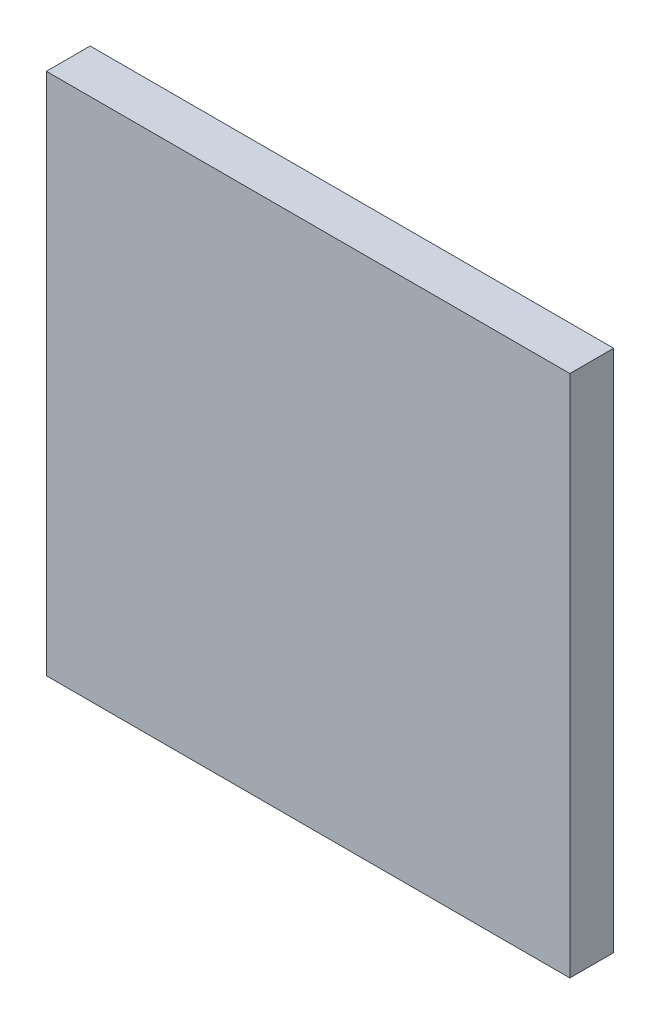
ISO-10303-21;
HEADER;
FILE_DESCRIPTION(('STEP AP214'),'2;1');
FILE_NAME('part.step','',(''),(''),'','','');
FILE_SCHEMA(('AUTOMOTIVE_DESIGN { 1 0 10303 214 1 1 1 1 }'));
ENDSEC;
DATA;
#1=APPLICATION_CONTEXT('core data for automotive mechanical design processes');
#2=APPLICATION_PROTOCOL_DEFINITION('international standard','automotive_design',2000,#1);
#3=PRODUCT_CONTEXT('',#1,'mechanical');
#4=PRODUCT('Part','Part','',(#3));
#5=PRODUCT_RELATED_PRODUCT_CATEGORY('part','',(#4));
#6=PRODUCT_DEFINITION_FORMATION('','',#4);
#7=PRODUCT_DEFINITION_CONTEXT('part definition',#1,'design');
#8=PRODUCT_DEFINITION('design','',#6,#7);
#9=PRODUCT_DEFINITION_SHAPE('','',#8);
#10=(LENGTH_UNIT() NAMED_UNIT(*) SI_UNIT(.MILLI.,.METRE.));
#11=(NAMED_UNIT(*) PLANE_ANGLE_UNIT() SI_UNIT($,.RADIAN.));
#12=(NAMED_UNIT(*) SI_UNIT($,.STERADIAN.) SOLID_ANGLE_UNIT());
#13=UNCERTAINTY_MEASURE_WITH_UNIT(LENGTH_MEASURE(1.E-05),#10,'distance_accuracy_value','');
#14=(GEOMETRIC_REPRESENTATION_CONTEXT(3) GLOBAL_UNCERTAINTY_ASSIGNED_CONTEXT((#13)) GLOBAL_UNIT_ASSIGNED_CONTEXT((#10,
#11,#12)) REPRESENTATION_CONTEXT('',''));
#15=CARTESIAN_POINT('',(0.,0.,0.));
#16=DIRECTION('',(0.,0.,1.));
#17=DIRECTION('',(1.,0.,0.));
#18=AXIS2_PLACEMENT_3D('',#15,#16,#17);
#19=CARTESIAN_POINT('',(1.1833740156735,1.4190983628665,1.7496000059366));
#20=DIRECTION('',(0.,1.,0.));
#21=DIRECTION('',(0.,0.,1.));
#22=AXIS2_PLACEMENT_3D('',#19,#20,#21);
#23=PLANE('',#22);
#24=DIRECTION('',(0.,0.,1.));
#25=VECTOR('',#24,1.);
#26=CARTESIAN_POINT('',(1.1809825082425,1.4190983628665,1.7492000059366));
#27=LINE('',#26,#25);
#28=CARTESIAN_POINT('',(1.1809825082425,1.4190983628665,1.7492000059366));
#29=VERTEX_POINT('',#28);
#30=CARTESIAN_POINT('',(1.1809825082425,1.4190983628665,1.7496000059366));
#31=VERTEX_POINT('',#30);
#32=EDGE_CURVE('E11',#29,#31,#27,.T.);
#33=ORIENTED_EDGE('',*,*,#32,.T.);
#34=DIRECTION('',(1.,0.,0.));
#35=VECTOR('',#34,1.);
#36=CARTESIAN_POINT('',(1.1809825082425,1.4190983628665,1.7496000059366));
#37=LINE('',#36,#35);
#38=CARTESIAN_POINT('',(1.1857655231045,1.4190983628665,1.7496000059366));
#39=VERTEX_POINT('',#38);
#40=EDGE_CURVE('E24',#31,#39,#37,.T.);
#41=ORIENTED_EDGE('',*,*,#40,.T.);
#42=DIRECTION('',(0.,0.,1.));
#43=VECTOR('',#42,1.);
#44=CARTESIAN_POINT('',(1.1857655231045,1.4190983628665,1.7492000059366));
#45=LINE('',#44,#43);
#46=CARTESIAN_POINT('',(1.1857655231045,1.4190983628665,1.7492000059366));
#47=VERTEX_POINT('',#46);
#48=EDGE_CURVE('E85',#47,#39,#45,.T.);
#49=ORIENTED_EDGE('',*,*,#48,.F.);
#50=DIRECTION('',(1.,0.,0.));
#51=VECTOR('',#50,1.);
#52=CARTESIAN_POINT('',(1.1809825082425,1.4190983628665,1.7492000059366));
#53=LINE('',#52,#51);
#54=EDGE_CURVE('E83',#29,#47,#53,.T.);
#55=ORIENTED_EDGE('',*,*,#54,.F.);
#56=EDGE_LOOP('',(#33,#41,#49,#55));
#57=FACE_BOUND('',#56,.T.);
#58=ADVANCED_FACE('F17',(#57),#23,.T.);
#59=CARTESIAN_POINT('',(1.1857655231045,1.4167068554355,1.7496000059366));
#60=DIRECTION('',(1.,0.,0.));
#61=DIRECTION('',(0.,0.,-1.));
#62=AXIS2_PLACEMENT_3D('',#59,#60,#61);
#63=PLANE('',#62);
#64=ORIENTED_EDGE('',*,*,#48,.T.);
#65=DIRECTION('',(0.,-1.,0.));
#66=VECTOR('',#65,1.);
#67=CARTESIAN_POINT('',(1.1857655231045,1.4190983628665,1.7496000059366));
#68=LINE('',#67,#66);
#69=CARTESIAN_POINT('',(1.1857655231045,1.4143153480045,1.7496000059366));
#70=VERTEX_POINT('',#69);
#71=EDGE_CURVE('E81',#39,#70,#68,.T.);
#72=ORIENTED_EDGE('',*,*,#71,.T.);
#73=DIRECTION('',(0.,0.,1.));
#74=VECTOR('',#73,1.);
#75=CARTESIAN_POINT('',(1.1857655231045,1.4143153480045,1.7492000059366));
#76=LINE('',#75,#74);
#77=CARTESIAN_POINT('',(1.1857655231045,1.4143153480045,1.7492000059366));
#78=VERTEX_POINT('',#77);
#79=EDGE_CURVE('E79',#78,#70,#76,.T.);
#80=ORIENTED_EDGE('',*,*,#79,.F.);
#81=DIRECTION('',(0.,-1.,0.));
#82=VECTOR('',#81,1.);
#83=CARTESIAN_POINT('',(1.1857655231045,1.4190983628665,1.7492000059366));
#84=LINE('',#83,#82);
#85=EDGE_CURVE('E70',#47,#78,#84,.T.);
#86=ORIENTED_EDGE('',*,*,#85,.F.);
#87=EDGE_LOOP('',(#64,#72,#80,#86));
#88=FACE_BOUND('',#87,.T.);
#89=ADVANCED_FACE('F90',(#88),#63,.T.);
#90=CARTESIAN_POINT('',(1.1833740156735,1.4143153480045,1.7496000059366));
#91=DIRECTION('',(0.,-1.,0.));
#92=DIRECTION('',(0.,0.,-1.));
#93=AXIS2_PLACEMENT_3D('',#90,#91,#92);
#94=PLANE('',#93);
#95=ORIENTED_EDGE('',*,*,#79,.T.);
#96=DIRECTION('',(-1.,0.,0.));
#97=VECTOR('',#96,1.);
#98=CARTESIAN_POINT('',(1.1857655231045,1.4143153480045,1.7496000059366));
#99=LINE('',#98,#97);
#100=CARTESIAN_POINT('',(1.1809825082425,1.4143153480045,1.7496000059366));
#101=VERTEX_POINT('',#100);
#102=EDGE_CURVE('E60',#70,#101,#99,.T.);
#103=ORIENTED_EDGE('',*,*,#102,.T.);
#104=DIRECTION('',(0.,0.,1.));
#105=VECTOR('',#104,1.);
#106=CARTESIAN_POINT('',(1.1809825082425,1.4143153480045,1.7492000059366));
#107=LINE('',#106,#105);
#108=CARTESIAN_POINT('',(1.1809825082425,1.4143153480045,1.7492000059366));
#109=VERTEX_POINT('',#108);
#110=EDGE_CURVE('E54',#109,#101,#107,.T.);
#111=ORIENTED_EDGE('',*,*,#110,.F.);
#112=DIRECTION('',(-1.,0.,0.));
#113=VECTOR('',#112,1.);
#114=CARTESIAN_POINT('',(1.1857655231045,1.4143153480045,1.7492000059366));
#115=LINE('',#114,#113);
#116=EDGE_CURVE('E58',#78,#109,#115,.T.);
#117=ORIENTED_EDGE('',*,*,#116,.F.);
#118=EDGE_LOOP('',(#95,#103,#111,#117));
#119=FACE_BOUND('',#118,.T.);
#120=ADVANCED_FACE('F57',(#119),#94,.T.);
#121=CARTESIAN_POINT('',(1.1809825082425,1.4167068554355,1.7496000059366));
#122=DIRECTION('',(-1.,0.,0.));
#123=DIRECTION('',(0.,0.,1.));
#124=AXIS2_PLACEMENT_3D('',#121,#122,#123);
#125=PLANE('',#124);
#126=ORIENTED_EDGE('',*,*,#110,.T.);
#127=DIRECTION('',(0.,1.,0.));
#128=VECTOR('',#127,1.);
#129=CARTESIAN_POINT('',(1.1809825082425,1.4143153480045,1.7496000059366));
#130=LINE('',#129,#128);
#131=EDGE_CURVE('E71',#101,#31,#130,.T.);
#132=ORIENTED_EDGE('',*,*,#131,.T.);
#133=ORIENTED_EDGE('',*,*,#32,.F.);
#134=DIRECTION('',(0.,1.,0.));
#135=VECTOR('',#134,1.);
#136=CARTESIAN_POINT('',(1.1809825082425,1.4143153480045,1.7492000059366));
#137=LINE('',#136,#135);
#138=EDGE_CURVE('E68',#109,#29,#137,.T.);
#139=ORIENTED_EDGE('',*,*,#138,.F.);
#140=EDGE_LOOP('',(#126,#132,#133,#139));
#141=FACE_BOUND('',#140,.T.);
#142=ADVANCED_FACE('F73',(#141),#125,.T.);
#143=CARTESIAN_POINT('',(1.1809825082425,1.4167068554355,1.7492000059366));
#144=DIRECTION('',(0.,0.,-1.));
#145=DIRECTION('',(-1.,0.,0.));
#146=AXIS2_PLACEMENT_3D('',#143,#144,#145);
#147=PLANE('',#146);
#148=ORIENTED_EDGE('',*,*,#54,.T.);
#149=ORIENTED_EDGE('',*,*,#85,.T.);
#150=ORIENTED_EDGE('',*,*,#116,.T.);
#151=ORIENTED_EDGE('',*,*,#138,.T.);
#152=EDGE_LOOP('',(#148,#149,#150,#151));
#153=FACE_BOUND('',#152,.T.);
#154=ADVANCED_FACE('F67',(#153),#147,.T.);
#155=CARTESIAN_POINT('',(1.1809825082425,1.4167068554355,1.7496000059366));
#156=DIRECTION('',(0.,0.,-1.));
#157=DIRECTION('',(-1.,0.,0.));
#158=AXIS2_PLACEMENT_3D('',#155,#156,#157);
#159=PLANE('',#158);
#160=ORIENTED_EDGE('',*,*,#40,.F.);
#161=ORIENTED_EDGE('',*,*,#131,.F.);
#162=ORIENTED_EDGE('',*,*,#102,.F.);
#163=ORIENTED_EDGE('',*,*,#71,.F.);
#164=EDGE_LOOP('',(#160,#161,#162,#163));
#165=FACE_BOUND('',#164,.T.);
#166=ADVANCED_FACE('F91',(#165),#159,.F.);
#167=CLOSED_SHELL('',(#58,#89,#120,#142,#154,#166));
#168=MANIFOLD_SOLID_BREP('B1',#167);
#169=ADVANCED_BREP_SHAPE_REPRESENTATION('',(#18,#168),#14);
#170=SHAPE_DEFINITION_REPRESENTATION(#9,#169);
ENDSEC;
END-ISO-10303-21;
